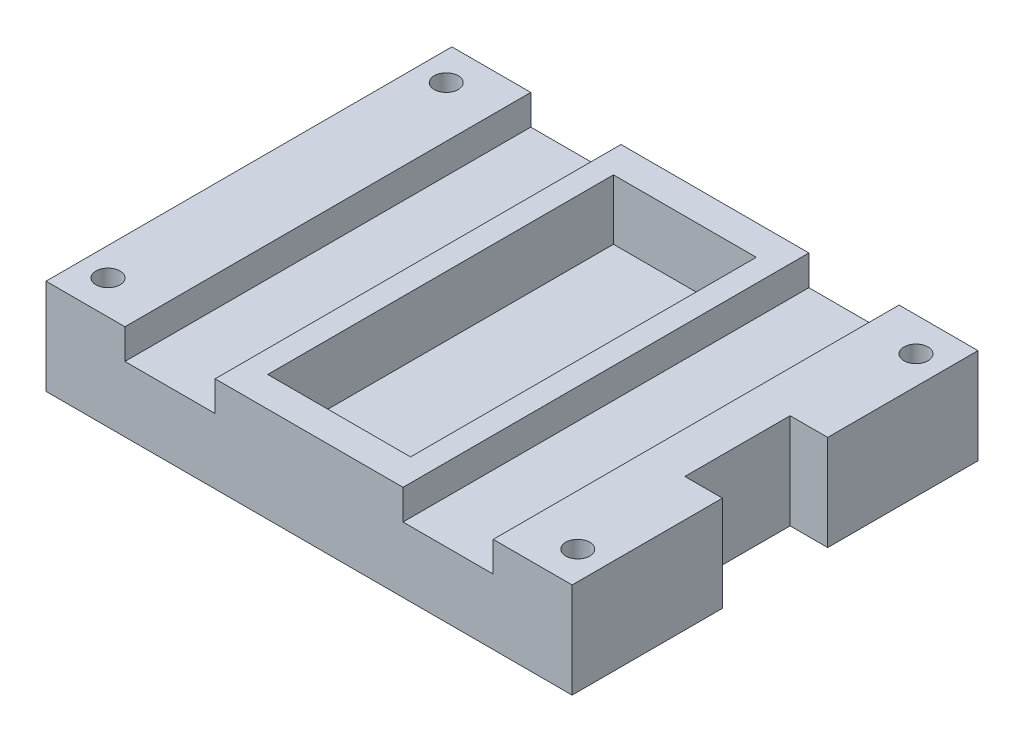
ISO-10303-21;
HEADER;
FILE_DESCRIPTION(('STEP AP214'),'2;1');
FILE_NAME('part.step','',(''),(''),'','','');
FILE_SCHEMA(('AUTOMOTIVE_DESIGN { 1 0 10303 214 1 1 1 1 }'));
ENDSEC;
DATA;
#1=APPLICATION_CONTEXT('core data for automotive mechanical design processes');
#2=APPLICATION_PROTOCOL_DEFINITION('international standard','automotive_design',2000,#1);
#3=PRODUCT_CONTEXT('',#1,'mechanical');
#4=PRODUCT('Part','Part','',(#3));
#5=PRODUCT_RELATED_PRODUCT_CATEGORY('part','',(#4));
#6=PRODUCT_DEFINITION_FORMATION('','',#4);
#7=PRODUCT_DEFINITION_CONTEXT('part definition',#1,'design');
#8=PRODUCT_DEFINITION('design','',#6,#7);
#9=PRODUCT_DEFINITION_SHAPE('','',#8);
#10=(LENGTH_UNIT() NAMED_UNIT(*) SI_UNIT(.MILLI.,.METRE.));
#11=(NAMED_UNIT(*) PLANE_ANGLE_UNIT() SI_UNIT($,.RADIAN.));
#12=(NAMED_UNIT(*) SI_UNIT($,.STERADIAN.) SOLID_ANGLE_UNIT());
#13=UNCERTAINTY_MEASURE_WITH_UNIT(LENGTH_MEASURE(1.E-05),#10,'distance_accuracy_value','');
#14=(GEOMETRIC_REPRESENTATION_CONTEXT(3) GLOBAL_UNCERTAINTY_ASSIGNED_CONTEXT((#13)) GLOBAL_UNIT_ASSIGNED_CONTEXT((#10,
#11,#12)) REPRESENTATION_CONTEXT('',''));
#15=CARTESIAN_POINT('',(0.,0.,0.));
#16=DIRECTION('',(0.,0.,1.));
#17=DIRECTION('',(1.,0.,0.));
#18=AXIS2_PLACEMENT_3D('',#15,#16,#17);
#19=CARTESIAN_POINT('',(75.8625203143752,12.7,98.));
#20=DIRECTION('',(0.,-1.,0.));
#21=DIRECTION('',(1.,0.,0.));
#22=AXIS2_PLACEMENT_3D('',#19,#20,#21);
#23=PLANE('',#22);
#24=CARTESIAN_POINT('',(66.25,12.7,26.5));
#25=DIRECTION('',(0.,1.,0.));
#26=DIRECTION('',(-1.,0.,0.));
#27=AXIS2_PLACEMENT_3D('',#24,#25,#26);
#28=CIRCLE('',#27,1.6);
#29=CARTESIAN_POINT('',(64.65,12.7,26.5));
#30=VERTEX_POINT('',#29);
#31=EDGE_CURVE('E314',#30,#30,#28,.T.);
#32=ORIENTED_EDGE('',*,*,#31,.F.);
#33=EDGE_LOOP('',(#32));
#34=FACE_BOUND('',#33,.T.);
#35=CARTESIAN_POINT('',(66.25,12.7,71.5));
#36=DIRECTION('',(0.,1.,0.));
#37=DIRECTION('',(-1.,0.,0.));
#38=AXIS2_PLACEMENT_3D('',#35,#36,#37);
#39=CIRCLE('',#38,1.60000000000001);
#40=CARTESIAN_POINT('',(64.65,12.7,71.5));
#41=VERTEX_POINT('',#40);
#42=EDGE_CURVE('E309',#41,#41,#39,.T.);
#43=ORIENTED_EDGE('',*,*,#42,.F.);
#44=EDGE_LOOP('',(#43));
#45=FACE_BOUND('',#44,.T.);
#46=DIRECTION('',(-1.,0.,0.));
#47=VECTOR('',#46,1.);
#48=CARTESIAN_POINT('',(37.,12.7,76.));
#49=LINE('',#48,#47);
#50=CARTESIAN_POINT('',(70.,12.7,76.));
#51=VERTEX_POINT('',#50);
#52=CARTESIAN_POINT('',(59.5,12.7,76.));
#53=VERTEX_POINT('',#52);
#54=EDGE_CURVE('E389',#51,#53,#49,.T.);
#55=ORIENTED_EDGE('',*,*,#54,.F.);
#56=DIRECTION('',(0.,0.,1.));
#57=VECTOR('',#56,1.);
#58=CARTESIAN_POINT('',(70.,12.7,0.));
#59=LINE('',#58,#57);
#60=CARTESIAN_POINT('',(70.,12.7,56.));
#61=VERTEX_POINT('',#60);
#62=EDGE_CURVE('E283',#61,#51,#59,.T.);
#63=ORIENTED_EDGE('',*,*,#62,.F.);
#64=DIRECTION('',(1.,0.,0.));
#65=VECTOR('',#64,1.);
#66=CARTESIAN_POINT('',(75.8625203143752,12.7,56.));
#67=LINE('',#66,#65);
#68=CARTESIAN_POINT('',(65.,12.7,56.));
#69=VERTEX_POINT('',#68);
#70=EDGE_CURVE('E296',#69,#61,#67,.T.);
#71=ORIENTED_EDGE('',*,*,#70,.F.);
#72=DIRECTION('',(0.,0.,1.));
#73=VECTOR('',#72,1.);
#74=CARTESIAN_POINT('',(65.,12.7,98.));
#75=LINE('',#74,#73);
#76=CARTESIAN_POINT('',(65.,12.7,42.));
#77=VERTEX_POINT('',#76);
#78=EDGE_CURVE('E307',#77,#69,#75,.T.);
#79=ORIENTED_EDGE('',*,*,#78,.F.);
#80=DIRECTION('',(1.,0.,0.));
#81=VECTOR('',#80,1.);
#82=CARTESIAN_POINT('',(75.8625203143752,12.7,42.));
#83=LINE('',#82,#81);
#84=CARTESIAN_POINT('',(70.,12.7,42.));
#85=VERTEX_POINT('',#84);
#86=EDGE_CURVE('E304',#77,#85,#83,.T.);
#87=ORIENTED_EDGE('',*,*,#86,.T.);
#88=CARTESIAN_POINT('',(70.,12.7,22.));
#89=VERTEX_POINT('',#88);
#90=EDGE_CURVE('E288',#89,#85,#59,.T.);
#91=ORIENTED_EDGE('',*,*,#90,.F.);
#92=DIRECTION('',(1.,0.,0.));
#93=VECTOR('',#92,1.);
#94=CARTESIAN_POINT('',(70.,12.7,22.));
#95=LINE('',#94,#93);
#96=CARTESIAN_POINT('',(59.5,12.7,22.));
#97=VERTEX_POINT('',#96);
#98=EDGE_CURVE('E381',#97,#89,#95,.T.);
#99=ORIENTED_EDGE('',*,*,#98,.F.);
#100=DIRECTION('',(0.,0.,1.));
#101=VECTOR('',#100,1.);
#102=CARTESIAN_POINT('',(59.5,12.7,0.));
#103=LINE('',#102,#101);
#104=EDGE_CURVE('E325',#97,#53,#103,.T.);
#105=ORIENTED_EDGE('',*,*,#104,.T.);
#106=EDGE_LOOP('',(#55,#63,#71,#79,#87,#91,#99,#105));
#107=FACE_BOUND('',#106,.T.);
#108=ADVANCED_FACE('F111',(#34,#45,#107),#23,.F.);
#109=CARTESIAN_POINT('',(0.,0.,98.));
#110=DIRECTION('',(0.,1.,0.));
#111=DIRECTION('',(0.,0.,1.));
#112=AXIS2_PLACEMENT_3D('',#109,#110,#111);
#113=PLANE('',#112);
#114=CARTESIAN_POINT('',(3.75,0.,71.5));
#115=DIRECTION('',(0.,1.,0.));
#116=DIRECTION('',(0.,0.,1.));
#117=AXIS2_PLACEMENT_3D('',#114,#115,#116);
#118=CIRCLE('',#117,1.6);
#119=CARTESIAN_POINT('',(3.75,0.,73.1));
#120=VERTEX_POINT('',#119);
#121=EDGE_CURVE('E321',#120,#120,#118,.T.);
#122=ORIENTED_EDGE('',*,*,#121,.T.);
#123=EDGE_LOOP('',(#122));
#124=FACE_BOUND('',#123,.T.);
#125=CARTESIAN_POINT('',(3.75,0.,26.5));
#126=DIRECTION('',(0.,1.,0.));
#127=DIRECTION('',(0.,0.,1.));
#128=AXIS2_PLACEMENT_3D('',#125,#126,#127);
#129=CIRCLE('',#128,1.6);
#130=CARTESIAN_POINT('',(3.75,0.,28.1));
#131=VERTEX_POINT('',#130);
#132=EDGE_CURVE('E415',#131,#131,#129,.T.);
#133=ORIENTED_EDGE('',*,*,#132,.T.);
#134=EDGE_LOOP('',(#133));
#135=FACE_BOUND('',#134,.T.);
#136=CARTESIAN_POINT('',(66.25,0.,26.5));
#137=DIRECTION('',(0.,1.,0.));
#138=DIRECTION('',(0.,0.,1.));
#139=AXIS2_PLACEMENT_3D('',#136,#137,#138);
#140=CIRCLE('',#139,1.6);
#141=CARTESIAN_POINT('',(66.25,0.,28.1));
#142=VERTEX_POINT('',#141);
#143=EDGE_CURVE('E418',#142,#142,#140,.T.);
#144=ORIENTED_EDGE('',*,*,#143,.T.);
#145=EDGE_LOOP('',(#144));
#146=FACE_BOUND('',#145,.T.);
#147=CARTESIAN_POINT('',(66.25,0.,71.5));
#148=DIRECTION('',(0.,1.,0.));
#149=DIRECTION('',(0.,0.,1.));
#150=AXIS2_PLACEMENT_3D('',#147,#148,#149);
#151=CIRCLE('',#150,1.60000000000001);
#152=CARTESIAN_POINT('',(66.25,0.,73.1));
#153=VERTEX_POINT('',#152);
#154=EDGE_CURVE('E345',#153,#153,#151,.T.);
#155=ORIENTED_EDGE('',*,*,#154,.T.);
#156=EDGE_LOOP('',(#155));
#157=FACE_BOUND('',#156,.T.);
#158=DIRECTION('',(1.,0.,0.));
#159=VECTOR('',#158,1.);
#160=CARTESIAN_POINT('',(0.,0.,22.));
#161=LINE('',#160,#159);
#162=CARTESIAN_POINT('',(0.,0.,22.));
#163=VERTEX_POINT('',#162);
#164=CARTESIAN_POINT('',(70.,0.,22.));
#165=VERTEX_POINT('',#164);
#166=EDGE_CURVE('E400',#163,#165,#161,.T.);
#167=ORIENTED_EDGE('',*,*,#166,.T.);
#168=DIRECTION('',(0.,0.,1.));
#169=VECTOR('',#168,1.);
#170=CARTESIAN_POINT('',(70.,0.,98.));
#171=LINE('',#170,#169);
#172=CARTESIAN_POINT('',(70.,0.,42.));
#173=VERTEX_POINT('',#172);
#174=EDGE_CURVE('E292',#165,#173,#171,.T.);
#175=ORIENTED_EDGE('',*,*,#174,.T.);
#176=DIRECTION('',(-1.,0.,0.));
#177=VECTOR('',#176,1.);
#178=CARTESIAN_POINT('',(0.,0.,42.));
#179=LINE('',#178,#177);
#180=CARTESIAN_POINT('',(65.,0.,42.));
#181=VERTEX_POINT('',#180);
#182=EDGE_CURVE('E119',#173,#181,#179,.T.);
#183=ORIENTED_EDGE('',*,*,#182,.T.);
#184=DIRECTION('',(0.,0.,-1.));
#185=VECTOR('',#184,1.);
#186=CARTESIAN_POINT('',(65.,0.,98.0000000000001));
#187=LINE('',#186,#185);
#188=CARTESIAN_POINT('',(65.,0.,56.));
#189=VERTEX_POINT('',#188);
#190=EDGE_CURVE('E12',#189,#181,#187,.T.);
#191=ORIENTED_EDGE('',*,*,#190,.F.);
#192=DIRECTION('',(-1.,0.,0.));
#193=VECTOR('',#192,1.);
#194=CARTESIAN_POINT('',(0.,0.,56.));
#195=LINE('',#194,#193);
#196=CARTESIAN_POINT('',(70.,0.,56.));
#197=VERTEX_POINT('',#196);
#198=EDGE_CURVE('E412',#197,#189,#195,.T.);
#199=ORIENTED_EDGE('',*,*,#198,.F.);
#200=CARTESIAN_POINT('',(70.,0.,76.));
#201=VERTEX_POINT('',#200);
#202=EDGE_CURVE('E289',#197,#201,#171,.T.);
#203=ORIENTED_EDGE('',*,*,#202,.T.);
#204=DIRECTION('',(-1.,0.,0.));
#205=VECTOR('',#204,1.);
#206=CARTESIAN_POINT('',(0.,0.,76.));
#207=LINE('',#206,#205);
#208=CARTESIAN_POINT('',(0.,0.,76.));
#209=VERTEX_POINT('',#208);
#210=EDGE_CURVE('E403',#201,#209,#207,.T.);
#211=ORIENTED_EDGE('',*,*,#210,.T.);
#212=DIRECTION('',(0.,0.,-1.));
#213=VECTOR('',#212,1.);
#214=CARTESIAN_POINT('',(0.,0.,98.));
#215=LINE('',#214,#213);
#216=EDGE_CURVE('E409',#209,#163,#215,.T.);
#217=ORIENTED_EDGE('',*,*,#216,.T.);
#218=EDGE_LOOP('',(#167,#175,#183,#191,#199,#203,#211,#217));
#219=FACE_BOUND('',#218,.T.);
#220=ADVANCED_FACE('F428',(#124,#135,#146,#157,#219),#113,.F.);
#221=CARTESIAN_POINT('',(3.74999999999999,12.7,26.5));
#222=DIRECTION('',(0.,1.,0.));
#223=DIRECTION('',(-1.,0.,0.));
#224=AXIS2_PLACEMENT_3D('',#221,#222,#223);
#225=CIRCLE('',#224,1.6);
#226=CARTESIAN_POINT('',(2.14999999999999,12.7,26.5));
#227=VERTEX_POINT('',#226);
#228=EDGE_CURVE('E310',#227,#227,#225,.T.);
#229=ORIENTED_EDGE('',*,*,#228,.F.);
#230=EDGE_LOOP('',(#229));
#231=FACE_BOUND('',#230,.T.);
#232=CARTESIAN_POINT('',(3.74999999999999,12.7,71.5));
#233=DIRECTION('',(0.,1.,0.));
#234=DIRECTION('',(-1.,0.,0.));
#235=AXIS2_PLACEMENT_3D('',#232,#233,#234);
#236=CIRCLE('',#235,1.6);
#237=CARTESIAN_POINT('',(2.14999999999999,12.7,71.5));
#238=VERTEX_POINT('',#237);
#239=EDGE_CURVE('E313',#238,#238,#236,.T.);
#240=ORIENTED_EDGE('',*,*,#239,.F.);
#241=EDGE_LOOP('',(#240));
#242=FACE_BOUND('',#241,.T.);
#243=DIRECTION('',(-1.,0.,0.));
#244=VECTOR('',#243,1.);
#245=CARTESIAN_POINT('',(0.,12.7,76.));
#246=LINE('',#245,#244);
#247=CARTESIAN_POINT('',(10.4999999999999,12.7,76.));
#248=VERTEX_POINT('',#247);
#249=CARTESIAN_POINT('',(0.,12.7,76.));
#250=VERTEX_POINT('',#249);
#251=EDGE_CURVE('E386',#248,#250,#246,.T.);
#252=ORIENTED_EDGE('',*,*,#251,.F.);
#253=DIRECTION('',(0.,0.,1.));
#254=VECTOR('',#253,1.);
#255=CARTESIAN_POINT('',(10.4999999999999,12.7,0.));
#256=LINE('',#255,#254);
#257=CARTESIAN_POINT('',(10.4999999999999,12.7,22.));
#258=VERTEX_POINT('',#257);
#259=EDGE_CURVE('E331',#258,#248,#256,.T.);
#260=ORIENTED_EDGE('',*,*,#259,.F.);
#261=DIRECTION('',(1.,0.,0.));
#262=VECTOR('',#261,1.);
#263=CARTESIAN_POINT('',(33.,12.7,22.));
#264=LINE('',#263,#262);
#265=CARTESIAN_POINT('',(0.,12.7,22.));
#266=VERTEX_POINT('',#265);
#267=EDGE_CURVE('E376',#266,#258,#264,.T.);
#268=ORIENTED_EDGE('',*,*,#267,.F.);
#269=DIRECTION('',(0.,0.,-1.));
#270=VECTOR('',#269,1.);
#271=CARTESIAN_POINT('',(0.,12.7,98.));
#272=LINE('',#271,#270);
#273=EDGE_CURVE('E406',#250,#266,#272,.T.);
#274=ORIENTED_EDGE('',*,*,#273,.F.);
#275=EDGE_LOOP('',(#252,#260,#268,#274));
#276=FACE_BOUND('',#275,.T.);
#277=ADVANCED_FACE('F456',(#231,#242,#276),#23,.F.);
#278=CARTESIAN_POINT('',(0.,12.7,98.));
#279=DIRECTION('',(1.,0.,0.));
#280=DIRECTION('',(0.,1.,0.));
#281=AXIS2_PLACEMENT_3D('',#278,#279,#280);
#282=PLANE('',#281);
#283=ORIENTED_EDGE('',*,*,#216,.F.);
#284=DIRECTION('',(0.,1.,0.));
#285=VECTOR('',#284,1.);
#286=CARTESIAN_POINT('',(0.,-12.3,76.));
#287=LINE('',#286,#285);
#288=EDGE_CURVE('E385',#209,#250,#287,.T.);
#289=ORIENTED_EDGE('',*,*,#288,.T.);
#290=ORIENTED_EDGE('',*,*,#273,.T.);
#291=DIRECTION('',(0.,1.,0.));
#292=VECTOR('',#291,1.);
#293=CARTESIAN_POINT('',(0.,-12.3,22.));
#294=LINE('',#293,#292);
#295=EDGE_CURVE('E379',#163,#266,#294,.T.);
#296=ORIENTED_EDGE('',*,*,#295,.F.);
#297=EDGE_LOOP('',(#283,#289,#290,#296));
#298=FACE_BOUND('',#297,.T.);
#299=ADVANCED_FACE('F113',(#298),#282,.F.);
#300=DIRECTION('',(1.,0.,0.));
#301=VECTOR('',#300,1.);
#302=CARTESIAN_POINT('',(25.4999999999999,12.7,72.));
#303=LINE('',#302,#301);
#304=CARTESIAN_POINT('',(25.4999999999999,12.7,72.));
#305=VERTEX_POINT('',#304);
#306=CARTESIAN_POINT('',(44.5,12.7,72.));
#307=VERTEX_POINT('',#306);
#308=EDGE_CURVE('E277',#305,#307,#303,.T.);
#309=ORIENTED_EDGE('',*,*,#308,.F.);
#310=DIRECTION('',(0.,0.,1.));
#311=VECTOR('',#310,1.);
#312=CARTESIAN_POINT('',(25.4999999999999,12.7,26.));
#313=LINE('',#312,#311);
#314=CARTESIAN_POINT('',(25.4999999999999,12.7,26.));
#315=VERTEX_POINT('',#314);
#316=EDGE_CURVE('E126',#315,#305,#313,.T.);
#317=ORIENTED_EDGE('',*,*,#316,.F.);
#318=DIRECTION('',(-1.,0.,0.));
#319=VECTOR('',#318,1.);
#320=CARTESIAN_POINT('',(25.4999999999999,12.7,26.));
#321=LINE('',#320,#319);
#322=CARTESIAN_POINT('',(44.4999999999999,12.7,26.));
#323=VERTEX_POINT('',#322);
#324=EDGE_CURVE('E268',#323,#315,#321,.T.);
#325=ORIENTED_EDGE('',*,*,#324,.F.);
#326=DIRECTION('',(0.,0.,-1.));
#327=VECTOR('',#326,1.);
#328=CARTESIAN_POINT('',(44.4999999999999,12.7,26.));
#329=LINE('',#328,#327);
#330=EDGE_CURVE('E271',#307,#323,#329,.T.);
#331=ORIENTED_EDGE('',*,*,#330,.F.);
#332=EDGE_LOOP('',(#309,#317,#325,#331));
#333=FACE_BOUND('',#332,.T.);
#334=CARTESIAN_POINT('',(22.4999999999999,12.7,22.));
#335=VERTEX_POINT('',#334);
#336=CARTESIAN_POINT('',(47.5,12.7,22.));
#337=VERTEX_POINT('',#336);
#338=EDGE_CURVE('E390',#335,#337,#95,.T.);
#339=ORIENTED_EDGE('',*,*,#338,.F.);
#340=DIRECTION('',(0.,0.,1.));
#341=VECTOR('',#340,1.);
#342=CARTESIAN_POINT('',(22.4999999999999,12.7,0.));
#343=LINE('',#342,#341);
#344=CARTESIAN_POINT('',(22.4999999999999,12.7,76.));
#345=VERTEX_POINT('',#344);
#346=EDGE_CURVE('E334',#335,#345,#343,.T.);
#347=ORIENTED_EDGE('',*,*,#346,.T.);
#348=CARTESIAN_POINT('',(47.5,12.7,76.));
#349=VERTEX_POINT('',#348);
#350=EDGE_CURVE('E382',#349,#345,#246,.T.);
#351=ORIENTED_EDGE('',*,*,#350,.F.);
#352=DIRECTION('',(0.,0.,1.));
#353=VECTOR('',#352,1.);
#354=CARTESIAN_POINT('',(47.5,12.7,0.));
#355=LINE('',#354,#353);
#356=EDGE_CURVE('E350',#337,#349,#355,.T.);
#357=ORIENTED_EDGE('',*,*,#356,.F.);
#358=EDGE_LOOP('',(#339,#347,#351,#357));
#359=FACE_BOUND('',#358,.T.);
#360=ADVANCED_FACE('F479',(#333,#359),#23,.F.);
#361=CARTESIAN_POINT('',(70.,-12.3,22.));
#362=DIRECTION('',(0.,0.,1.));
#363=DIRECTION('',(1.,0.,0.));
#364=AXIS2_PLACEMENT_3D('',#361,#362,#363);
#365=PLANE('',#364);
#366=DIRECTION('',(1.,0.,0.));
#367=VECTOR('',#366,1.);
#368=CARTESIAN_POINT('',(70.,8.7,22.));
#369=LINE('',#368,#367);
#370=CARTESIAN_POINT('',(47.5,8.7,22.));
#371=VERTEX_POINT('',#370);
#372=CARTESIAN_POINT('',(59.5,8.7,22.));
#373=VERTEX_POINT('',#372);
#374=EDGE_CURVE('E370',#371,#373,#369,.T.);
#375=ORIENTED_EDGE('',*,*,#374,.T.);
#376=DIRECTION('',(0.,1.,0.));
#377=VECTOR('',#376,1.);
#378=CARTESIAN_POINT('',(59.5,-12.3,22.));
#379=LINE('',#378,#377);
#380=EDGE_CURVE('E373',#373,#97,#379,.T.);
#381=ORIENTED_EDGE('',*,*,#380,.T.);
#382=ORIENTED_EDGE('',*,*,#98,.T.);
#383=DIRECTION('',(0.,1.,0.));
#384=VECTOR('',#383,1.);
#385=CARTESIAN_POINT('',(70.,-12.3,22.));
#386=LINE('',#385,#384);
#387=EDGE_CURVE('E393',#165,#89,#386,.T.);
#388=ORIENTED_EDGE('',*,*,#387,.F.);
#389=ORIENTED_EDGE('',*,*,#166,.F.);
#390=ORIENTED_EDGE('',*,*,#295,.T.);
#391=ORIENTED_EDGE('',*,*,#267,.T.);
#392=DIRECTION('',(0.,-1.,0.));
#393=VECTOR('',#392,1.);
#394=CARTESIAN_POINT('',(10.4999999999999,-12.3,22.));
#395=LINE('',#394,#393);
#396=CARTESIAN_POINT('',(10.4999999999999,8.69999999999999,22.));
#397=VERTEX_POINT('',#396);
#398=EDGE_CURVE('E364',#258,#397,#395,.T.);
#399=ORIENTED_EDGE('',*,*,#398,.T.);
#400=DIRECTION('',(1.,0.,0.));
#401=VECTOR('',#400,1.);
#402=CARTESIAN_POINT('',(33.,8.69999999999999,22.));
#403=LINE('',#402,#401);
#404=CARTESIAN_POINT('',(22.4999999999999,8.69999999999999,22.));
#405=VERTEX_POINT('',#404);
#406=EDGE_CURVE('E333',#397,#405,#403,.T.);
#407=ORIENTED_EDGE('',*,*,#406,.T.);
#408=DIRECTION('',(0.,1.,0.));
#409=VECTOR('',#408,1.);
#410=CARTESIAN_POINT('',(22.4999999999999,-12.3,22.));
#411=LINE('',#410,#409);
#412=EDGE_CURVE('E361',#405,#335,#411,.T.);
#413=ORIENTED_EDGE('',*,*,#412,.T.);
#414=ORIENTED_EDGE('',*,*,#338,.T.);
#415=DIRECTION('',(0.,-1.,0.));
#416=VECTOR('',#415,1.);
#417=CARTESIAN_POINT('',(47.5,-12.3000000000001,22.));
#418=LINE('',#417,#416);
#419=EDGE_CURVE('E367',#337,#371,#418,.T.);
#420=ORIENTED_EDGE('',*,*,#419,.T.);
#421=EDGE_LOOP('',(#375,#381,#382,#388,#389,#390,#391,#399,#407,#413,#414,#420));
#422=FACE_BOUND('',#421,.T.);
#423=ADVANCED_FACE('F459',(#422),#365,.F.);
#424=CARTESIAN_POINT('',(0.,-12.3,76.));
#425=DIRECTION('',(0.,0.,-1.));
#426=DIRECTION('',(-1.,0.,0.));
#427=AXIS2_PLACEMENT_3D('',#424,#425,#426);
#428=PLANE('',#427);
#429=DIRECTION('',(1.,0.,0.));
#430=VECTOR('',#429,1.);
#431=CARTESIAN_POINT('',(10.4999999999999,8.69999999999999,76.));
#432=LINE('',#431,#430);
#433=CARTESIAN_POINT('',(10.4999999999999,8.69999999999999,76.));
#434=VERTEX_POINT('',#433);
#435=CARTESIAN_POINT('',(22.4999999999999,8.69999999999999,76.));
#436=VERTEX_POINT('',#435);
#437=EDGE_CURVE('E324',#434,#436,#432,.T.);
#438=ORIENTED_EDGE('',*,*,#437,.F.);
#439=DIRECTION('',(0.,-1.,0.));
#440=VECTOR('',#439,1.);
#441=CARTESIAN_POINT('',(10.4999999999999,12.7,76.));
#442=LINE('',#441,#440);
#443=EDGE_CURVE('E322',#248,#434,#442,.T.);
#444=ORIENTED_EDGE('',*,*,#443,.F.);
#445=ORIENTED_EDGE('',*,*,#251,.T.);
#446=ORIENTED_EDGE('',*,*,#288,.F.);
#447=ORIENTED_EDGE('',*,*,#210,.F.);
#448=DIRECTION('',(0.,1.,0.));
#449=VECTOR('',#448,1.);
#450=CARTESIAN_POINT('',(70.,-12.3,76.));
#451=LINE('',#450,#449);
#452=EDGE_CURVE('E397',#201,#51,#451,.T.);
#453=ORIENTED_EDGE('',*,*,#452,.T.);
#454=ORIENTED_EDGE('',*,*,#54,.T.);
#455=DIRECTION('',(0.,1.,0.));
#456=VECTOR('',#455,1.);
#457=CARTESIAN_POINT('',(59.5,12.7,76.));
#458=LINE('',#457,#456);
#459=CARTESIAN_POINT('',(59.5,8.7,76.));
#460=VERTEX_POINT('',#459);
#461=EDGE_CURVE('E348',#460,#53,#458,.T.);
#462=ORIENTED_EDGE('',*,*,#461,.F.);
#463=DIRECTION('',(1.,0.,0.));
#464=VECTOR('',#463,1.);
#465=CARTESIAN_POINT('',(59.5,8.7,76.));
#466=LINE('',#465,#464);
#467=CARTESIAN_POINT('',(47.5,8.7,76.));
#468=VERTEX_POINT('',#467);
#469=EDGE_CURVE('E344',#468,#460,#466,.T.);
#470=ORIENTED_EDGE('',*,*,#469,.F.);
#471=DIRECTION('',(0.,-1.,0.));
#472=VECTOR('',#471,1.);
#473=CARTESIAN_POINT('',(47.5,12.7,76.));
#474=LINE('',#473,#472);
#475=EDGE_CURVE('E341',#349,#468,#474,.T.);
#476=ORIENTED_EDGE('',*,*,#475,.F.);
#477=ORIENTED_EDGE('',*,*,#350,.T.);
#478=DIRECTION('',(0.,1.,0.));
#479=VECTOR('',#478,1.);
#480=CARTESIAN_POINT('',(22.4999999999999,12.7,76.));
#481=LINE('',#480,#479);
#482=EDGE_CURVE('E328',#436,#345,#481,.T.);
#483=ORIENTED_EDGE('',*,*,#482,.F.);
#484=EDGE_LOOP('',(#438,#444,#445,#446,#447,#453,#454,#462,#470,#476,#477,#483));
#485=FACE_BOUND('',#484,.T.);
#486=ADVANCED_FACE('F448',(#485),#428,.F.);
#487=CARTESIAN_POINT('',(10.4999999999999,12.7,0.));
#488=DIRECTION('',(-1.,0.,0.));
#489=DIRECTION('',(0.,-1.,0.));
#490=AXIS2_PLACEMENT_3D('',#487,#488,#489);
#491=PLANE('',#490);
#492=ORIENTED_EDGE('',*,*,#259,.T.);
#493=ORIENTED_EDGE('',*,*,#443,.T.);
#494=DIRECTION('',(0.,0.,1.));
#495=VECTOR('',#494,1.);
#496=CARTESIAN_POINT('',(10.4999999999999,8.69999999999999,0.));
#497=LINE('',#496,#495);
#498=EDGE_CURVE('E330',#397,#434,#497,.T.);
#499=ORIENTED_EDGE('',*,*,#498,.F.);
#500=ORIENTED_EDGE('',*,*,#398,.F.);
#501=EDGE_LOOP('',(#492,#493,#499,#500));
#502=FACE_BOUND('',#501,.T.);
#503=ADVANCED_FACE('F488',(#502),#491,.F.);
#504=CARTESIAN_POINT('',(22.4999999999999,12.7,0.));
#505=DIRECTION('',(1.,0.,0.));
#506=DIRECTION('',(0.,0.,-1.));
#507=AXIS2_PLACEMENT_3D('',#504,#505,#506);
#508=PLANE('',#507);
#509=DIRECTION('',(0.,0.,1.));
#510=VECTOR('',#509,1.);
#511=CARTESIAN_POINT('',(22.4999999999999,8.69999999999999,0.));
#512=LINE('',#511,#510);
#513=EDGE_CURVE('E337',#405,#436,#512,.T.);
#514=ORIENTED_EDGE('',*,*,#513,.T.);
#515=ORIENTED_EDGE('',*,*,#482,.T.);
#516=ORIENTED_EDGE('',*,*,#346,.F.);
#517=ORIENTED_EDGE('',*,*,#412,.F.);
#518=EDGE_LOOP('',(#514,#515,#516,#517));
#519=FACE_BOUND('',#518,.T.);
#520=ADVANCED_FACE('F482',(#519),#508,.F.);
#521=CARTESIAN_POINT('',(10.4999999999999,8.69999999999999,0.));
#522=DIRECTION('',(0.,-1.,0.));
#523=DIRECTION('',(0.,0.,-1.));
#524=AXIS2_PLACEMENT_3D('',#521,#522,#523);
#525=PLANE('',#524);
#526=ORIENTED_EDGE('',*,*,#498,.T.);
#527=ORIENTED_EDGE('',*,*,#437,.T.);
#528=ORIENTED_EDGE('',*,*,#513,.F.);
#529=ORIENTED_EDGE('',*,*,#406,.F.);
#530=EDGE_LOOP('',(#526,#527,#528,#529));
#531=FACE_BOUND('',#530,.T.);
#532=ADVANCED_FACE('F486',(#531),#525,.F.);
#533=CARTESIAN_POINT('',(59.5,12.7,0.));
#534=DIRECTION('',(1.,0.,0.));
#535=DIRECTION('',(0.,1.,0.));
#536=AXIS2_PLACEMENT_3D('',#533,#534,#535);
#537=PLANE('',#536);
#538=DIRECTION('',(0.,0.,1.));
#539=VECTOR('',#538,1.);
#540=CARTESIAN_POINT('',(59.5,8.7,0.));
#541=LINE('',#540,#539);
#542=EDGE_CURVE('E353',#373,#460,#541,.T.);
#543=ORIENTED_EDGE('',*,*,#542,.T.);
#544=ORIENTED_EDGE('',*,*,#461,.T.);
#545=ORIENTED_EDGE('',*,*,#104,.F.);
#546=ORIENTED_EDGE('',*,*,#380,.F.);
#547=EDGE_LOOP('',(#543,#544,#545,#546));
#548=FACE_BOUND('',#547,.T.);
#549=ADVANCED_FACE('F469',(#548),#537,.F.);
#550=CARTESIAN_POINT('',(59.5,8.7,0.));
#551=DIRECTION('',(0.,-1.,0.));
#552=DIRECTION('',(1.,0.,0.));
#553=AXIS2_PLACEMENT_3D('',#550,#551,#552);
#554=PLANE('',#553);
#555=DIRECTION('',(0.,0.,1.));
#556=VECTOR('',#555,1.);
#557=CARTESIAN_POINT('',(47.5,8.7,0.));
#558=LINE('',#557,#556);
#559=EDGE_CURVE('E355',#371,#468,#558,.T.);
#560=ORIENTED_EDGE('',*,*,#559,.T.);
#561=ORIENTED_EDGE('',*,*,#469,.T.);
#562=ORIENTED_EDGE('',*,*,#542,.F.);
#563=ORIENTED_EDGE('',*,*,#374,.F.);
#564=EDGE_LOOP('',(#560,#561,#562,#563));
#565=FACE_BOUND('',#564,.T.);
#566=ADVANCED_FACE('F472',(#565),#554,.F.);
#567=CARTESIAN_POINT('',(47.5,12.7,0.));
#568=DIRECTION('',(-1.,0.,0.));
#569=DIRECTION('',(0.,-1.,0.));
#570=AXIS2_PLACEMENT_3D('',#567,#568,#569);
#571=PLANE('',#570);
#572=ORIENTED_EDGE('',*,*,#356,.T.);
#573=ORIENTED_EDGE('',*,*,#475,.T.);
#574=ORIENTED_EDGE('',*,*,#559,.F.);
#575=ORIENTED_EDGE('',*,*,#419,.F.);
#576=EDGE_LOOP('',(#572,#573,#574,#575));
#577=FACE_BOUND('',#576,.T.);
#578=ADVANCED_FACE('F475',(#577),#571,.F.);
#579=CARTESIAN_POINT('',(3.75,-7.30000000000001,71.5));
#580=DIRECTION('',(0.,1.,0.));
#581=DIRECTION('',(-1.,0.,0.));
#582=AXIS2_PLACEMENT_3D('',#579,#580,#581);
#583=CYLINDRICAL_SURFACE('',#582,1.6);
#584=ORIENTED_EDGE('',*,*,#239,.T.);
#585=EDGE_LOOP('',(#584));
#586=FACE_BOUND('',#585,.T.);
#587=ORIENTED_EDGE('',*,*,#121,.F.);
#588=EDGE_LOOP('',(#587));
#589=FACE_BOUND('',#588,.T.);
#590=ADVANCED_FACE('F549',(#586,#589),#583,.F.);
#591=CARTESIAN_POINT('',(3.75,-7.30000000000001,26.5));
#592=DIRECTION('',(0.,1.,0.));
#593=DIRECTION('',(-1.,0.,0.));
#594=AXIS2_PLACEMENT_3D('',#591,#592,#593);
#595=CYLINDRICAL_SURFACE('',#594,1.6);
#596=ORIENTED_EDGE('',*,*,#228,.T.);
#597=EDGE_LOOP('',(#596));
#598=FACE_BOUND('',#597,.T.);
#599=ORIENTED_EDGE('',*,*,#132,.F.);
#600=EDGE_LOOP('',(#599));
#601=FACE_BOUND('',#600,.T.);
#602=ADVANCED_FACE('F545',(#598,#601),#595,.F.);
#603=CARTESIAN_POINT('',(66.25,-7.3,26.5));
#604=DIRECTION('',(0.,1.,0.));
#605=DIRECTION('',(-1.,0.,0.));
#606=AXIS2_PLACEMENT_3D('',#603,#604,#605);
#607=CYLINDRICAL_SURFACE('',#606,1.6);
#608=ORIENTED_EDGE('',*,*,#31,.T.);
#609=EDGE_LOOP('',(#608));
#610=FACE_BOUND('',#609,.T.);
#611=ORIENTED_EDGE('',*,*,#143,.F.);
#612=EDGE_LOOP('',(#611));
#613=FACE_BOUND('',#612,.T.);
#614=ADVANCED_FACE('F548',(#610,#613),#607,.F.);
#615=CARTESIAN_POINT('',(66.25,-7.3,71.5));
#616=DIRECTION('',(0.,1.,0.));
#617=DIRECTION('',(-1.,0.,0.));
#618=AXIS2_PLACEMENT_3D('',#615,#616,#617);
#619=CYLINDRICAL_SURFACE('',#618,1.60000000000001);
#620=ORIENTED_EDGE('',*,*,#42,.T.);
#621=EDGE_LOOP('',(#620));
#622=FACE_BOUND('',#621,.T.);
#623=ORIENTED_EDGE('',*,*,#154,.F.);
#624=EDGE_LOOP('',(#623));
#625=FACE_BOUND('',#624,.T.);
#626=ADVANCED_FACE('F544',(#622,#625),#619,.F.);
#627=CARTESIAN_POINT('',(65.0000000000001,-28.3,0.));
#628=DIRECTION('',(1.,0.,0.));
#629=DIRECTION('',(0.,0.,-1.));
#630=AXIS2_PLACEMENT_3D('',#627,#628,#629);
#631=PLANE('',#630);
#632=ORIENTED_EDGE('',*,*,#78,.T.);
#633=DIRECTION('',(0.,1.,0.));
#634=VECTOR('',#633,1.);
#635=CARTESIAN_POINT('',(65.,-28.3,56.));
#636=LINE('',#635,#634);
#637=EDGE_CURVE('E134',#189,#69,#636,.T.);
#638=ORIENTED_EDGE('',*,*,#637,.F.);
#639=ORIENTED_EDGE('',*,*,#190,.T.);
#640=DIRECTION('',(0.,1.,0.));
#641=VECTOR('',#640,1.);
#642=CARTESIAN_POINT('',(65.,-28.3,42.));
#643=LINE('',#642,#641);
#644=EDGE_CURVE('E293',#181,#77,#643,.T.);
#645=ORIENTED_EDGE('',*,*,#644,.T.);
#646=EDGE_LOOP('',(#632,#638,#639,#645));
#647=FACE_BOUND('',#646,.T.);
#648=ADVANCED_FACE('F435',(#647),#631,.T.);
#649=CARTESIAN_POINT('',(0.,-28.3,42.));
#650=DIRECTION('',(0.,0.,-1.));
#651=DIRECTION('',(-1.,0.,0.));
#652=AXIS2_PLACEMENT_3D('',#649,#650,#651);
#653=PLANE('',#652);
#654=ORIENTED_EDGE('',*,*,#644,.F.);
#655=ORIENTED_EDGE('',*,*,#182,.F.);
#656=DIRECTION('',(0.,1.,0.));
#657=VECTOR('',#656,1.);
#658=CARTESIAN_POINT('',(70.,-28.3,42.));
#659=LINE('',#658,#657);
#660=EDGE_CURVE('E297',#173,#85,#659,.T.);
#661=ORIENTED_EDGE('',*,*,#660,.T.);
#662=ORIENTED_EDGE('',*,*,#86,.F.);
#663=EDGE_LOOP('',(#654,#655,#661,#662));
#664=FACE_BOUND('',#663,.T.);
#665=ADVANCED_FACE('F432',(#664),#653,.F.);
#666=CARTESIAN_POINT('',(0.,-28.3,56.));
#667=DIRECTION('',(0.,0.,-1.));
#668=DIRECTION('',(-1.,0.,0.));
#669=AXIS2_PLACEMENT_3D('',#666,#667,#668);
#670=PLANE('',#669);
#671=ORIENTED_EDGE('',*,*,#70,.T.);
#672=DIRECTION('',(0.,1.,0.));
#673=VECTOR('',#672,1.);
#674=CARTESIAN_POINT('',(70.,-28.3,56.));
#675=LINE('',#674,#673);
#676=EDGE_CURVE('E300',#197,#61,#675,.T.);
#677=ORIENTED_EDGE('',*,*,#676,.F.);
#678=ORIENTED_EDGE('',*,*,#198,.T.);
#679=ORIENTED_EDGE('',*,*,#637,.T.);
#680=EDGE_LOOP('',(#671,#677,#678,#679));
#681=FACE_BOUND('',#680,.T.);
#682=ADVANCED_FACE('F442',(#681),#670,.T.);
#683=CARTESIAN_POINT('',(70.,-7.3,0.));
#684=DIRECTION('',(-1.,0.,0.));
#685=DIRECTION('',(0.,-1.,0.));
#686=AXIS2_PLACEMENT_3D('',#683,#684,#685);
#687=PLANE('',#686);
#688=ORIENTED_EDGE('',*,*,#202,.F.);
#689=ORIENTED_EDGE('',*,*,#676,.T.);
#690=ORIENTED_EDGE('',*,*,#62,.T.);
#691=ORIENTED_EDGE('',*,*,#452,.F.);
#692=EDGE_LOOP('',(#688,#689,#690,#691));
#693=FACE_BOUND('',#692,.T.);
#694=ADVANCED_FACE('F537',(#693),#687,.F.);
#695=ORIENTED_EDGE('',*,*,#387,.T.);
#696=ORIENTED_EDGE('',*,*,#90,.T.);
#697=ORIENTED_EDGE('',*,*,#660,.F.);
#698=ORIENTED_EDGE('',*,*,#174,.F.);
#699=EDGE_LOOP('',(#695,#696,#697,#698));
#700=FACE_BOUND('',#699,.T.);
#701=ADVANCED_FACE('F464',(#700),#687,.F.);
#702=CARTESIAN_POINT('',(25.4999999999999,4.69999999999999,26.));
#703=DIRECTION('',(-1.,0.,0.));
#704=DIRECTION('',(0.,0.,1.));
#705=AXIS2_PLACEMENT_3D('',#702,#703,#704);
#706=PLANE('',#705);
#707=ORIENTED_EDGE('',*,*,#316,.T.);
#708=DIRECTION('',(0.,1.,0.));
#709=VECTOR('',#708,1.);
#710=CARTESIAN_POINT('',(25.4999999999999,4.69999999999999,72.));
#711=LINE('',#710,#709);
#712=CARTESIAN_POINT('',(25.4999999999999,4.69999999999999,72.));
#713=VERTEX_POINT('',#712);
#714=EDGE_CURVE('E246',#713,#305,#711,.T.);
#715=ORIENTED_EDGE('',*,*,#714,.F.);
#716=DIRECTION('',(0.,0.,1.));
#717=VECTOR('',#716,1.);
#718=CARTESIAN_POINT('',(25.4999999999999,4.69999999999999,26.));
#719=LINE('',#718,#717);
#720=CARTESIAN_POINT('',(25.4999999999999,4.69999999999999,26.));
#721=VERTEX_POINT('',#720);
#722=EDGE_CURVE('E250',#721,#713,#719,.T.);
#723=ORIENTED_EDGE('',*,*,#722,.F.);
#724=DIRECTION('',(0.,1.,0.));
#725=VECTOR('',#724,1.);
#726=CARTESIAN_POINT('',(25.4999999999999,4.69999999999999,26.));
#727=LINE('',#726,#725);
#728=EDGE_CURVE('E281',#721,#315,#727,.T.);
#729=ORIENTED_EDGE('',*,*,#728,.T.);
#730=EDGE_LOOP('',(#707,#715,#723,#729));
#731=FACE_BOUND('',#730,.T.);
#732=ADVANCED_FACE('F248',(#731),#706,.F.);
#733=CARTESIAN_POINT('',(25.4999999999999,4.69999999999999,26.));
#734=DIRECTION('',(0.,0.,-1.));
#735=DIRECTION('',(-1.,0.,0.));
#736=AXIS2_PLACEMENT_3D('',#733,#734,#735);
#737=PLANE('',#736);
#738=ORIENTED_EDGE('',*,*,#324,.T.);
#739=ORIENTED_EDGE('',*,*,#728,.F.);
#740=DIRECTION('',(-1.,0.,0.));
#741=VECTOR('',#740,1.);
#742=CARTESIAN_POINT('',(25.4999999999999,4.69999999999999,26.));
#743=LINE('',#742,#741);
#744=CARTESIAN_POINT('',(44.4999999999999,4.7,26.));
#745=VERTEX_POINT('',#744);
#746=EDGE_CURVE('E256',#745,#721,#743,.T.);
#747=ORIENTED_EDGE('',*,*,#746,.F.);
#748=DIRECTION('',(0.,1.,0.));
#749=VECTOR('',#748,1.);
#750=CARTESIAN_POINT('',(44.4999999999999,4.7,26.));
#751=LINE('',#750,#749);
#752=EDGE_CURVE('E284',#745,#323,#751,.T.);
#753=ORIENTED_EDGE('',*,*,#752,.T.);
#754=EDGE_LOOP('',(#738,#739,#747,#753));
#755=FACE_BOUND('',#754,.T.);
#756=ADVANCED_FACE('F522',(#755),#737,.F.);
#757=CARTESIAN_POINT('',(44.4999999999999,4.7,26.));
#758=DIRECTION('',(1.,0.,0.));
#759=DIRECTION('',(0.,0.,-1.));
#760=AXIS2_PLACEMENT_3D('',#757,#758,#759);
#761=PLANE('',#760);
#762=ORIENTED_EDGE('',*,*,#330,.T.);
#763=ORIENTED_EDGE('',*,*,#752,.F.);
#764=DIRECTION('',(0.,0.,-1.));
#765=VECTOR('',#764,1.);
#766=CARTESIAN_POINT('',(44.4999999999999,4.7,26.));
#767=LINE('',#766,#765);
#768=CARTESIAN_POINT('',(44.5,4.7,72.));
#769=VERTEX_POINT('',#768);
#770=EDGE_CURVE('E264',#769,#745,#767,.T.);
#771=ORIENTED_EDGE('',*,*,#770,.F.);
#772=DIRECTION('',(0.,1.,0.));
#773=VECTOR('',#772,1.);
#774=CARTESIAN_POINT('',(44.5,4.7,72.));
#775=LINE('',#774,#773);
#776=EDGE_CURVE('E255',#769,#307,#775,.T.);
#777=ORIENTED_EDGE('',*,*,#776,.T.);
#778=EDGE_LOOP('',(#762,#763,#771,#777));
#779=FACE_BOUND('',#778,.T.);
#780=ADVANCED_FACE('F520',(#779),#761,.F.);
#781=CARTESIAN_POINT('',(25.4999999999999,4.69999999999999,72.));
#782=DIRECTION('',(0.,0.,1.));
#783=DIRECTION('',(1.,0.,0.));
#784=AXIS2_PLACEMENT_3D('',#781,#782,#783);
#785=PLANE('',#784);
#786=ORIENTED_EDGE('',*,*,#308,.T.);
#787=ORIENTED_EDGE('',*,*,#776,.F.);
#788=DIRECTION('',(1.,0.,0.));
#789=VECTOR('',#788,1.);
#790=CARTESIAN_POINT('',(25.4999999999999,4.69999999999999,72.));
#791=LINE('',#790,#789);
#792=EDGE_CURVE('E259',#713,#769,#791,.T.);
#793=ORIENTED_EDGE('',*,*,#792,.F.);
#794=ORIENTED_EDGE('',*,*,#714,.T.);
#795=EDGE_LOOP('',(#786,#787,#793,#794));
#796=FACE_BOUND('',#795,.T.);
#797=ADVANCED_FACE('F260',(#796),#785,.F.);
#798=CARTESIAN_POINT('',(0.,4.69999999999999,0.));
#799=DIRECTION('',(0.,1.,0.));
#800=DIRECTION('',(-1.,0.,0.));
#801=AXIS2_PLACEMENT_3D('',#798,#799,#800);
#802=PLANE('',#801);
#803=ORIENTED_EDGE('',*,*,#722,.T.);
#804=ORIENTED_EDGE('',*,*,#792,.T.);
#805=ORIENTED_EDGE('',*,*,#770,.T.);
#806=ORIENTED_EDGE('',*,*,#746,.T.);
#807=EDGE_LOOP('',(#803,#804,#805,#806));
#808=FACE_BOUND('',#807,.T.);
#809=ADVANCED_FACE('F266',(#808),#802,.T.);
#810=CLOSED_SHELL('',(#108,#220,#277,#299,#360,#423,#486,#503,#520,#532,#549,#566,#578,#590,
#602,#614,#626,#648,#665,#682,#694,#701,#732,#756,#780,#797,#809));
#811=MANIFOLD_SOLID_BREP('B2',#810);
#812=ADVANCED_BREP_SHAPE_REPRESENTATION('',(#18,#811),#14);
#813=SHAPE_DEFINITION_REPRESENTATION(#9,#812);
ENDSEC;
END-ISO-10303-21;
